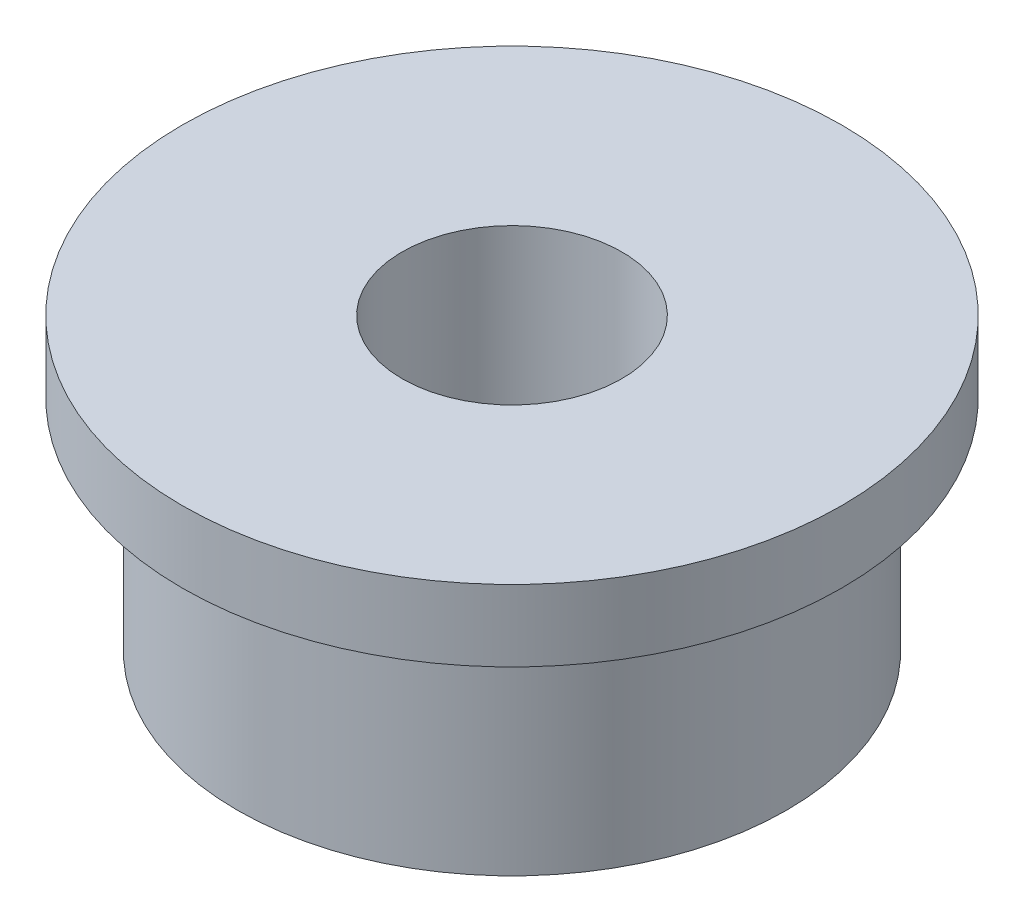
ISO-10303-21;
HEADER;
FILE_DESCRIPTION(('STEP AP214'),'2;1');
FILE_NAME('part.step','',(''),(''),'','','');
FILE_SCHEMA(('AUTOMOTIVE_DESIGN { 1 0 10303 214 1 1 1 1 }'));
ENDSEC;
DATA;
#1=APPLICATION_CONTEXT('core data for automotive mechanical design processes');
#2=APPLICATION_PROTOCOL_DEFINITION('international standard','automotive_design',2000,#1);
#3=PRODUCT_CONTEXT('',#1,'mechanical');
#4=PRODUCT('Part','Part','',(#3));
#5=PRODUCT_RELATED_PRODUCT_CATEGORY('part','',(#4));
#6=PRODUCT_DEFINITION_FORMATION('','',#4);
#7=PRODUCT_DEFINITION_CONTEXT('part definition',#1,'design');
#8=PRODUCT_DEFINITION('design','',#6,#7);
#9=PRODUCT_DEFINITION_SHAPE('','',#8);
#10=(LENGTH_UNIT() NAMED_UNIT(*) SI_UNIT(.MILLI.,.METRE.));
#11=(NAMED_UNIT(*) PLANE_ANGLE_UNIT() SI_UNIT($,.RADIAN.));
#12=(NAMED_UNIT(*) SI_UNIT($,.STERADIAN.) SOLID_ANGLE_UNIT());
#13=UNCERTAINTY_MEASURE_WITH_UNIT(LENGTH_MEASURE(1.E-05),#10,'distance_accuracy_value','');
#14=(GEOMETRIC_REPRESENTATION_CONTEXT(3) GLOBAL_UNCERTAINTY_ASSIGNED_CONTEXT((#13)) GLOBAL_UNIT_ASSIGNED_CONTEXT((#10,
#11,#12)) REPRESENTATION_CONTEXT('',''));
#15=CARTESIAN_POINT('',(0.,0.,0.));
#16=DIRECTION('',(0.,0.,1.));
#17=DIRECTION('',(1.,0.,0.));
#18=AXIS2_PLACEMENT_3D('',#15,#16,#17);
#19=CARTESIAN_POINT('',(0.,0.,0.));
#20=DIRECTION('',(0.,1.,0.));
#21=DIRECTION('',(0.,0.,1.));
#22=AXIS2_PLACEMENT_3D('',#19,#20,#21);
#23=PLANE('',#22);
#24=CARTESIAN_POINT('',(0.,0.,0.));
#25=DIRECTION('',(0.,1.,0.));
#26=DIRECTION('',(0.,0.,1.));
#27=AXIS2_PLACEMENT_3D('',#24,#25,#26);
#28=CIRCLE('',#27,2.5);
#29=CARTESIAN_POINT('',(0.,0.,2.5));
#30=VERTEX_POINT('',#29);
#31=EDGE_CURVE('E45',#30,#30,#28,.T.);
#32=ORIENTED_EDGE('',*,*,#31,.F.);
#33=EDGE_LOOP('',(#32));
#34=FACE_BOUND('',#33,.T.);
#35=CARTESIAN_POINT('',(0.,0.,0.));
#36=DIRECTION('',(0.,1.,0.));
#37=DIRECTION('',(0.,0.,1.));
#38=AXIS2_PLACEMENT_3D('',#35,#36,#37);
#39=CIRCLE('',#38,1.);
#40=CARTESIAN_POINT('',(0.,0.,1.));
#41=VERTEX_POINT('',#40);
#42=EDGE_CURVE('E52',#41,#41,#39,.T.);
#43=ORIENTED_EDGE('',*,*,#42,.T.);
#44=EDGE_LOOP('',(#43));
#45=FACE_BOUND('',#44,.T.);
#46=ADVANCED_FACE('F41',(#34,#45),#23,.F.);
#47=CARTESIAN_POINT('',(0.,2.,0.));
#48=DIRECTION('',(0.,-1.,0.));
#49=DIRECTION('',(0.,0.,-1.));
#50=AXIS2_PLACEMENT_3D('',#47,#48,#49);
#51=CYLINDRICAL_SURFACE('',#50,2.5);
#52=CARTESIAN_POINT('',(0.,2.,0.));
#53=DIRECTION('',(0.,1.,0.));
#54=DIRECTION('',(0.,0.,1.));
#55=AXIS2_PLACEMENT_3D('',#52,#53,#54);
#56=CIRCLE('',#55,2.5);
#57=CARTESIAN_POINT('',(0.,2.,2.5));
#58=VERTEX_POINT('',#57);
#59=EDGE_CURVE('E10',#58,#58,#56,.T.);
#60=ORIENTED_EDGE('',*,*,#59,.F.);
#61=EDGE_LOOP('',(#60));
#62=FACE_BOUND('',#61,.T.);
#63=ORIENTED_EDGE('',*,*,#31,.T.);
#64=EDGE_LOOP('',(#63));
#65=FACE_BOUND('',#64,.T.);
#66=ADVANCED_FACE('F43',(#62,#65),#51,.T.);
#67=CARTESIAN_POINT('',(0.,2.,0.));
#68=DIRECTION('',(0.,-1.,0.));
#69=DIRECTION('',(0.,0.,-1.));
#70=AXIS2_PLACEMENT_3D('',#67,#68,#69);
#71=CYLINDRICAL_SURFACE('',#70,1.);
#72=ORIENTED_EDGE('',*,*,#42,.F.);
#73=EDGE_LOOP('',(#72));
#74=FACE_BOUND('',#73,.T.);
#75=CARTESIAN_POINT('',(0.,2.65,0.));
#76=DIRECTION('',(0.,1.,0.));
#77=DIRECTION('',(0.,0.,1.));
#78=AXIS2_PLACEMENT_3D('',#75,#76,#77);
#79=CIRCLE('',#78,1.);
#80=CARTESIAN_POINT('',(0.,2.65,1.));
#81=VERTEX_POINT('',#80);
#82=EDGE_CURVE('E60',#81,#81,#79,.T.);
#83=ORIENTED_EDGE('',*,*,#82,.T.);
#84=EDGE_LOOP('',(#83));
#85=FACE_BOUND('',#84,.T.);
#86=ADVANCED_FACE('F66',(#74,#85),#71,.F.);
#87=CARTESIAN_POINT('',(0.,2.65,0.));
#88=DIRECTION('',(0.,1.,0.));
#89=DIRECTION('',(0.,0.,1.));
#90=AXIS2_PLACEMENT_3D('',#87,#88,#89);
#91=PLANE('',#90);
#92=CARTESIAN_POINT('',(0.,2.65,0.));
#93=DIRECTION('',(0.,1.,0.));
#94=DIRECTION('',(0.,0.,1.));
#95=AXIS2_PLACEMENT_3D('',#92,#93,#94);
#96=CIRCLE('',#95,3.);
#97=CARTESIAN_POINT('',(0.,2.65,3.));
#98=VERTEX_POINT('',#97);
#99=EDGE_CURVE('E56',#98,#98,#96,.T.);
#100=ORIENTED_EDGE('',*,*,#99,.T.);
#101=EDGE_LOOP('',(#100));
#102=FACE_BOUND('',#101,.T.);
#103=ORIENTED_EDGE('',*,*,#82,.F.);
#104=EDGE_LOOP('',(#103));
#105=FACE_BOUND('',#104,.T.);
#106=ADVANCED_FACE('F68',(#102,#105),#91,.T.);
#107=CARTESIAN_POINT('',(0.,2.,0.));
#108=DIRECTION('',(0.,1.,0.));
#109=DIRECTION('',(0.,0.,1.));
#110=AXIS2_PLACEMENT_3D('',#107,#108,#109);
#111=PLANE('',#110);
#112=ORIENTED_EDGE('',*,*,#59,.T.);
#113=EDGE_LOOP('',(#112));
#114=FACE_BOUND('',#113,.T.);
#115=CARTESIAN_POINT('',(0.,2.,0.));
#116=DIRECTION('',(0.,1.,0.));
#117=DIRECTION('',(0.,0.,1.));
#118=AXIS2_PLACEMENT_3D('',#115,#116,#117);
#119=CIRCLE('',#118,3.);
#120=CARTESIAN_POINT('',(0.,2.,3.));
#121=VERTEX_POINT('',#120);
#122=EDGE_CURVE('E57',#121,#121,#119,.T.);
#123=ORIENTED_EDGE('',*,*,#122,.F.);
#124=EDGE_LOOP('',(#123));
#125=FACE_BOUND('',#124,.T.);
#126=ADVANCED_FACE('F70',(#114,#125),#111,.F.);
#127=CARTESIAN_POINT('',(0.,2.65,0.));
#128=DIRECTION('',(0.,-1.,0.));
#129=DIRECTION('',(0.,0.,-1.));
#130=AXIS2_PLACEMENT_3D('',#127,#128,#129);
#131=CYLINDRICAL_SURFACE('',#130,3.);
#132=ORIENTED_EDGE('',*,*,#99,.F.);
#133=EDGE_LOOP('',(#132));
#134=FACE_BOUND('',#133,.T.);
#135=ORIENTED_EDGE('',*,*,#122,.T.);
#136=EDGE_LOOP('',(#135));
#137=FACE_BOUND('',#136,.T.);
#138=ADVANCED_FACE('F77',(#134,#137),#131,.T.);
#139=CLOSED_SHELL('',(#46,#66,#86,#106,#126,#138));
#140=MANIFOLD_SOLID_BREP('B2',#139);
#141=ADVANCED_BREP_SHAPE_REPRESENTATION('',(#18,#140),#14);
#142=SHAPE_DEFINITION_REPRESENTATION(#9,#141);
ENDSEC;
END-ISO-10303-21;
